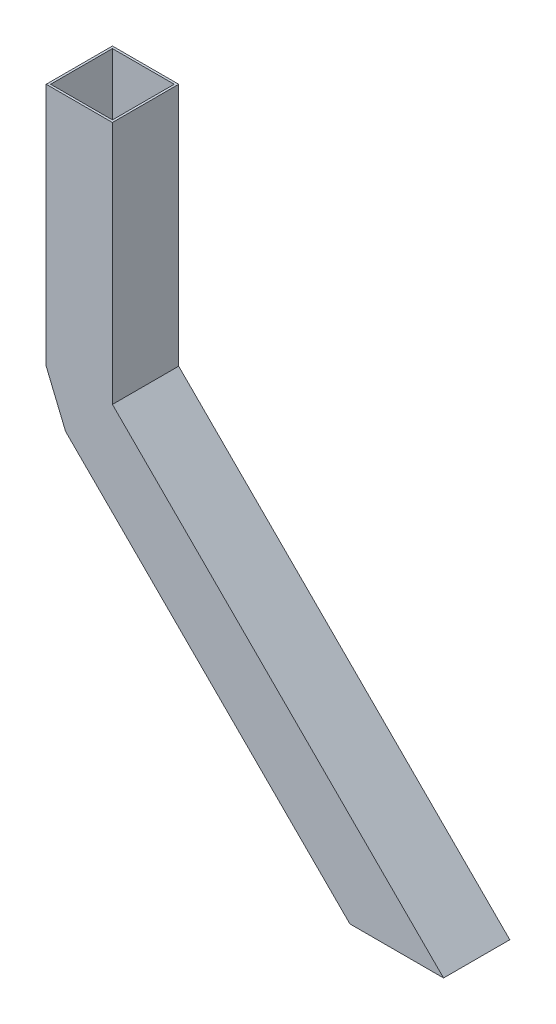
ISO-10303-21;
HEADER;
FILE_DESCRIPTION(('STEP AP214'),'2;1');
FILE_NAME('part.step','',(''),(''),'','','');
FILE_SCHEMA(('AUTOMOTIVE_DESIGN { 1 0 10303 214 1 1 1 1 }'));
ENDSEC;
DATA;
#1=APPLICATION_CONTEXT('core data for automotive mechanical design processes');
#2=APPLICATION_PROTOCOL_DEFINITION('international standard','automotive_design',2000,#1);
#3=PRODUCT_CONTEXT('',#1,'mechanical');
#4=PRODUCT('Part','Part','',(#3));
#5=PRODUCT_RELATED_PRODUCT_CATEGORY('part','',(#4));
#6=PRODUCT_DEFINITION_FORMATION('','',#4);
#7=PRODUCT_DEFINITION_CONTEXT('part definition',#1,'design');
#8=PRODUCT_DEFINITION('design','',#6,#7);
#9=PRODUCT_DEFINITION_SHAPE('','',#8);
#10=(LENGTH_UNIT() NAMED_UNIT(*) SI_UNIT(.MILLI.,.METRE.));
#11=(NAMED_UNIT(*) PLANE_ANGLE_UNIT() SI_UNIT($,.RADIAN.));
#12=(NAMED_UNIT(*) SI_UNIT($,.STERADIAN.) SOLID_ANGLE_UNIT());
#13=UNCERTAINTY_MEASURE_WITH_UNIT(LENGTH_MEASURE(1.E-05),#10,'distance_accuracy_value','');
#14=(GEOMETRIC_REPRESENTATION_CONTEXT(3) GLOBAL_UNCERTAINTY_ASSIGNED_CONTEXT((#13)) GLOBAL_UNIT_ASSIGNED_CONTEXT((#10,
#11,#12)) REPRESENTATION_CONTEXT('',''));
#15=CARTESIAN_POINT('',(0.,0.,0.));
#16=DIRECTION('',(0.,0.,1.));
#17=DIRECTION('',(1.,0.,0.));
#18=AXIS2_PLACEMENT_3D('',#15,#16,#17);
#19=CARTESIAN_POINT('',(0.,221.22,0.));
#20=DIRECTION('',(0.,-1.,0.));
#21=DIRECTION('',(0.,0.,-1.));
#22=AXIS2_PLACEMENT_3D('',#19,#20,#21);
#23=PLANE('',#22);
#24=DIRECTION('',(0.,0.,-1.));
#25=VECTOR('',#24,1.);
#26=CARTESIAN_POINT('',(30.0000000000001,221.22,30.));
#27=LINE('',#26,#25);
#28=CARTESIAN_POINT('',(30.0000000000001,221.22,30.));
#29=VERTEX_POINT('',#28);
#30=CARTESIAN_POINT('',(30.,221.22,-30.));
#31=VERTEX_POINT('',#30);
#32=EDGE_CURVE('E287',#29,#31,#27,.T.);
#33=ORIENTED_EDGE('',*,*,#32,.T.);
#34=DIRECTION('',(-1.,0.,0.));
#35=VECTOR('',#34,1.);
#36=CARTESIAN_POINT('',(-30.,221.22,-30.));
#37=LINE('',#36,#35);
#38=CARTESIAN_POINT('',(-30.,221.22,-30.));
#39=VERTEX_POINT('',#38);
#40=EDGE_CURVE('E291',#31,#39,#37,.T.);
#41=ORIENTED_EDGE('',*,*,#40,.T.);
#42=DIRECTION('',(0.,0.,1.));
#43=VECTOR('',#42,1.);
#44=CARTESIAN_POINT('',(-30.,221.22,30.));
#45=LINE('',#44,#43);
#46=CARTESIAN_POINT('',(-30.,221.22,30.));
#47=VERTEX_POINT('',#46);
#48=EDGE_CURVE('E295',#39,#47,#45,.T.);
#49=ORIENTED_EDGE('',*,*,#48,.T.);
#50=DIRECTION('',(1.,0.,0.));
#51=VECTOR('',#50,1.);
#52=CARTESIAN_POINT('',(-30.,221.22,30.));
#53=LINE('',#52,#51);
#54=EDGE_CURVE('E298',#47,#29,#53,.T.);
#55=ORIENTED_EDGE('',*,*,#54,.T.);
#56=EDGE_LOOP('',(#33,#41,#49,#55));
#57=FACE_BOUND('',#56,.T.);
#58=DIRECTION('',(1.,0.,0.));
#59=VECTOR('',#58,1.);
#60=CARTESIAN_POINT('',(-28.,221.22,28.));
#61=LINE('',#60,#59);
#62=CARTESIAN_POINT('',(-28.,221.22,28.));
#63=VERTEX_POINT('',#62);
#64=CARTESIAN_POINT('',(28.,221.22,28.));
#65=VERTEX_POINT('',#64);
#66=EDGE_CURVE('E257',#63,#65,#61,.T.);
#67=ORIENTED_EDGE('',*,*,#66,.F.);
#68=DIRECTION('',(0.,0.,1.));
#69=VECTOR('',#68,1.);
#70=CARTESIAN_POINT('',(-28.,221.22,28.));
#71=LINE('',#70,#69);
#72=CARTESIAN_POINT('',(-28.,221.22,-28.));
#73=VERTEX_POINT('',#72);
#74=EDGE_CURVE('E267',#73,#63,#71,.T.);
#75=ORIENTED_EDGE('',*,*,#74,.F.);
#76=DIRECTION('',(-1.,0.,0.));
#77=VECTOR('',#76,1.);
#78=CARTESIAN_POINT('',(-28.,221.22,-28.));
#79=LINE('',#78,#77);
#80=CARTESIAN_POINT('',(28.,221.22,-28.));
#81=VERTEX_POINT('',#80);
#82=EDGE_CURVE('E263',#81,#73,#79,.T.);
#83=ORIENTED_EDGE('',*,*,#82,.F.);
#84=DIRECTION('',(0.,0.,-1.));
#85=VECTOR('',#84,1.);
#86=CARTESIAN_POINT('',(28.,221.22,28.));
#87=LINE('',#86,#85);
#88=EDGE_CURVE('E260',#65,#81,#87,.T.);
#89=ORIENTED_EDGE('',*,*,#88,.F.);
#90=EDGE_LOOP('',(#67,#75,#83,#89));
#91=FACE_BOUND('',#90,.T.);
#92=ADVANCED_FACE('F46',(#57,#91),#23,.F.);
#93=CARTESIAN_POINT('',(30.0000000000001,221.22,30.));
#94=DIRECTION('',(-1.,0.,0.));
#95=DIRECTION('',(0.,0.,1.));
#96=AXIS2_PLACEMENT_3D('',#93,#94,#95);
#97=PLANE('',#96);
#98=DIRECTION('',(0.,0.,-1.));
#99=VECTOR('',#98,1.);
#100=CARTESIAN_POINT('',(30.0000000000001,0.,30.));
#101=LINE('',#100,#99);
#102=CARTESIAN_POINT('',(30.0000000000001,0.,30.));
#103=VERTEX_POINT('',#102);
#104=CARTESIAN_POINT('',(30.,0.,-30.));
#105=VERTEX_POINT('',#104);
#106=EDGE_CURVE('E286',#103,#105,#101,.T.);
#107=ORIENTED_EDGE('',*,*,#106,.T.);
#108=DIRECTION('',(0.,-1.,0.));
#109=VECTOR('',#108,1.);
#110=CARTESIAN_POINT('',(30.,221.22,-30.));
#111=LINE('',#110,#109);
#112=EDGE_CURVE('E55',#31,#105,#111,.T.);
#113=ORIENTED_EDGE('',*,*,#112,.F.);
#114=ORIENTED_EDGE('',*,*,#32,.F.);
#115=DIRECTION('',(0.,-1.,0.));
#116=VECTOR('',#115,1.);
#117=CARTESIAN_POINT('',(30.0000000000001,221.22,30.));
#118=LINE('',#117,#116);
#119=EDGE_CURVE('E301',#29,#103,#118,.T.);
#120=ORIENTED_EDGE('',*,*,#119,.T.);
#121=EDGE_LOOP('',(#107,#113,#114,#120));
#122=FACE_BOUND('',#121,.T.);
#123=ADVANCED_FACE('F48',(#122),#97,.F.);
#124=CARTESIAN_POINT('',(-30.,221.22,-30.));
#125=DIRECTION('',(0.,0.,1.));
#126=DIRECTION('',(1.,0.,0.));
#127=AXIS2_PLACEMENT_3D('',#124,#125,#126);
#128=PLANE('',#127);
#129=ORIENTED_EDGE('',*,*,#112,.T.);
#130=DIRECTION('',(-0.707106781186551,0.707106781186544,0.));
#131=VECTOR('',#130,1.);
#132=CARTESIAN_POINT('',(329.997122986206,-299.997122986203,-30.0000000000002));
#133=LINE('',#132,#131);
#134=CARTESIAN_POINT('',(329.997122986206,-299.997122986203,-30.0000000000002));
#135=VERTEX_POINT('',#134);
#136=EDGE_CURVE('E184',#135,#105,#133,.T.);
#137=ORIENTED_EDGE('',*,*,#136,.F.);
#138=DIRECTION('',(-1.,0.,0.));
#139=VECTOR('',#138,1.);
#140=CARTESIAN_POINT('',(329.997122986206,-299.997122986203,-30.0000000000002));
#141=LINE('',#140,#139);
#142=CARTESIAN_POINT('',(245.14430924382,-299.997122986203,-30.0000000000002));
#143=VERTEX_POINT('',#142);
#144=EDGE_CURVE('E168',#135,#143,#141,.T.);
#145=ORIENTED_EDGE('',*,*,#144,.T.);
#146=DIRECTION('',(-0.707106781186551,0.707106781186544,0.));
#147=VECTOR('',#146,1.);
#148=CARTESIAN_POINT('',(287.570716115014,-342.423529857396,-30.0000000000001));
#149=LINE('',#148,#147);
#150=CARTESIAN_POINT('',(-12.4264068711926,-42.4264068711931,-30.));
#151=VERTEX_POINT('',#150);
#152=EDGE_CURVE('E189',#143,#151,#149,.T.);
#153=ORIENTED_EDGE('',*,*,#152,.T.);
#154=DIRECTION('',(-0.382683432365093,0.923879532511286,0.));
#155=VECTOR('',#154,1.);
#156=CARTESIAN_POINT('',(-12.4264068711926,-42.4264068711931,-30.));
#157=LINE('',#156,#155);
#158=CARTESIAN_POINT('',(-30.,0.,-30.));
#159=VERTEX_POINT('',#158);
#160=EDGE_CURVE('E200',#151,#159,#157,.T.);
#161=ORIENTED_EDGE('',*,*,#160,.T.);
#162=DIRECTION('',(0.,-1.,0.));
#163=VECTOR('',#162,1.);
#164=CARTESIAN_POINT('',(-30.,221.22,-30.));
#165=LINE('',#164,#163);
#166=EDGE_CURVE('E314',#39,#159,#165,.T.);
#167=ORIENTED_EDGE('',*,*,#166,.F.);
#168=ORIENTED_EDGE('',*,*,#40,.F.);
#169=EDGE_LOOP('',(#129,#137,#145,#153,#161,#167,#168));
#170=FACE_BOUND('',#169,.T.);
#171=ADVANCED_FACE('F192',(#170),#128,.F.);
#172=CARTESIAN_POINT('',(-30.,221.22,30.));
#173=DIRECTION('',(1.,0.,0.));
#174=DIRECTION('',(0.,0.,-1.));
#175=AXIS2_PLACEMENT_3D('',#172,#173,#174);
#176=PLANE('',#175);
#177=DIRECTION('',(0.,0.,1.));
#178=VECTOR('',#177,1.);
#179=CARTESIAN_POINT('',(-30.,0.,30.));
#180=LINE('',#179,#178);
#181=CARTESIAN_POINT('',(-30.,0.,30.));
#182=VERTEX_POINT('',#181);
#183=EDGE_CURVE('E292',#159,#182,#180,.T.);
#184=ORIENTED_EDGE('',*,*,#183,.T.);
#185=DIRECTION('',(0.,-1.,0.));
#186=VECTOR('',#185,1.);
#187=CARTESIAN_POINT('',(-30.,221.22,30.));
#188=LINE('',#187,#186);
#189=EDGE_CURVE('E310',#47,#182,#188,.T.);
#190=ORIENTED_EDGE('',*,*,#189,.F.);
#191=ORIENTED_EDGE('',*,*,#48,.F.);
#192=ORIENTED_EDGE('',*,*,#166,.T.);
#193=EDGE_LOOP('',(#184,#190,#191,#192));
#194=FACE_BOUND('',#193,.T.);
#195=ADVANCED_FACE('F321',(#194),#176,.F.);
#196=CARTESIAN_POINT('',(-30.,221.22,30.));
#197=DIRECTION('',(0.,0.,-1.));
#198=DIRECTION('',(-1.,0.,0.));
#199=AXIS2_PLACEMENT_3D('',#196,#197,#198);
#200=PLANE('',#199);
#201=ORIENTED_EDGE('',*,*,#189,.T.);
#202=DIRECTION('',(-0.382683432365093,0.923879532511286,0.));
#203=VECTOR('',#202,1.);
#204=CARTESIAN_POINT('',(-12.4264068711926,-42.4264068711931,30.));
#205=LINE('',#204,#203);
#206=CARTESIAN_POINT('',(-12.4264068711926,-42.4264068711931,30.));
#207=VERTEX_POINT('',#206);
#208=EDGE_CURVE('E239',#207,#182,#205,.T.);
#209=ORIENTED_EDGE('',*,*,#208,.F.);
#210=DIRECTION('',(-0.707106781186551,0.707106781186544,0.));
#211=VECTOR('',#210,1.);
#212=CARTESIAN_POINT('',(287.570716115014,-342.423529857396,29.9999999999999));
#213=LINE('',#212,#211);
#214=CARTESIAN_POINT('',(245.14430924382,-299.997122986203,29.9999999999999));
#215=VERTEX_POINT('',#214);
#216=EDGE_CURVE('E202',#215,#207,#213,.T.);
#217=ORIENTED_EDGE('',*,*,#216,.F.);
#218=DIRECTION('',(-1.,0.,0.));
#219=VECTOR('',#218,1.);
#220=CARTESIAN_POINT('',(329.997122986206,-299.997122986203,30.));
#221=LINE('',#220,#219);
#222=CARTESIAN_POINT('',(329.997122986206,-299.997122986203,30.));
#223=VERTEX_POINT('',#222);
#224=EDGE_CURVE('E179',#223,#215,#221,.T.);
#225=ORIENTED_EDGE('',*,*,#224,.F.);
#226=DIRECTION('',(-0.707106781186551,0.707106781186544,0.));
#227=VECTOR('',#226,1.);
#228=CARTESIAN_POINT('',(329.997122986206,-299.997122986203,29.9999999999998));
#229=LINE('',#228,#227);
#230=EDGE_CURVE('E187',#223,#103,#229,.T.);
#231=ORIENTED_EDGE('',*,*,#230,.T.);
#232=ORIENTED_EDGE('',*,*,#119,.F.);
#233=ORIENTED_EDGE('',*,*,#54,.F.);
#234=EDGE_LOOP('',(#201,#209,#217,#225,#231,#232,#233));
#235=FACE_BOUND('',#234,.T.);
#236=ADVANCED_FACE('F330',(#235),#200,.F.);
#237=CARTESIAN_POINT('',(-28.,221.22,28.));
#238=DIRECTION('',(0.,0.,-1.));
#239=DIRECTION('',(-1.,0.,0.));
#240=AXIS2_PLACEMENT_3D('',#237,#238,#239);
#241=PLANE('',#240);
#242=DIRECTION('',(0.382683432365093,-0.923879532511286,0.));
#243=VECTOR('',#242,1.);
#244=CARTESIAN_POINT('',(-56.7069844126347,209.329177721454,28.));
#245=LINE('',#244,#243);
#246=CARTESIAN_POINT('',(12.4264068711926,42.4264068711931,28.));
#247=VERTEX_POINT('',#246);
#248=CARTESIAN_POINT('',(28.,4.82842712474621,28.));
#249=VERTEX_POINT('',#248);
#250=EDGE_CURVE('E62',#247,#249,#245,.T.);
#251=ORIENTED_EDGE('',*,*,#250,.F.);
#252=DIRECTION('',(-0.707106781186544,-0.707106781186551,0.));
#253=VECTOR('',#252,1.);
#254=CARTESIAN_POINT('',(81.61,111.610000000001,28.));
#255=LINE('',#254,#253);
#256=CARTESIAN_POINT('',(11.0121933088195,41.01219330882,28.));
#257=VERTEX_POINT('',#256);
#258=EDGE_CURVE('E247',#247,#257,#255,.T.);
#259=ORIENTED_EDGE('',*,*,#258,.T.);
#260=DIRECTION('',(-0.382683432365093,0.923879532511286,0.));
#261=VECTOR('',#260,1.);
#262=CARTESIAN_POINT('',(28.585786437627,-1.41421356237313,28.));
#263=LINE('',#262,#261);
#264=CARTESIAN_POINT('',(28.585786437627,-1.41421356237312,28.));
#265=VERTEX_POINT('',#264);
#266=EDGE_CURVE('E70',#265,#257,#263,.T.);
#267=ORIENTED_EDGE('',*,*,#266,.F.);
#268=DIRECTION('',(-0.707106781186551,0.707106781186544,0.));
#269=VECTOR('',#268,1.);
#270=CARTESIAN_POINT('',(328.582909423833,-301.411336548576,27.9999999999998));
#271=LINE('',#270,#269);
#272=CARTESIAN_POINT('',(327.16869586146,-299.997122986203,27.9999999999998));
#273=VERTEX_POINT('',#272);
#274=EDGE_CURVE('E351',#273,#265,#271,.T.);
#275=ORIENTED_EDGE('',*,*,#274,.F.);
#276=DIRECTION('',(1.,0.,0.));
#277=VECTOR('',#276,1.);
#278=CARTESIAN_POINT('',(288.984929677387,-299.997122986203,27.9999999999999));
#279=LINE('',#278,#277);
#280=CARTESIAN_POINT('',(247.972736368566,-299.997122986203,28.));
#281=VERTEX_POINT('',#280);
#282=EDGE_CURVE('E348',#281,#273,#279,.T.);
#283=ORIENTED_EDGE('',*,*,#282,.F.);
#284=DIRECTION('',(-0.707106781186551,0.707106781186544,0.));
#285=VECTOR('',#284,1.);
#286=CARTESIAN_POINT('',(288.984929677387,-341.009316295023,27.9999999999999));
#287=LINE('',#286,#285);
#288=CARTESIAN_POINT('',(-11.0121933088195,-41.01219330882,28.));
#289=VERTEX_POINT('',#288);
#290=EDGE_CURVE('E190',#281,#289,#287,.T.);
#291=ORIENTED_EDGE('',*,*,#290,.T.);
#292=DIRECTION('',(-0.382683432365093,0.923879532511286,0.));
#293=VECTOR('',#292,1.);
#294=CARTESIAN_POINT('',(-11.0121933088195,-41.01219330882,28.));
#295=LINE('',#294,#293);
#296=CARTESIAN_POINT('',(-28.,0.,28.));
#297=VERTEX_POINT('',#296);
#298=EDGE_CURVE('E217',#289,#297,#295,.T.);
#299=ORIENTED_EDGE('',*,*,#298,.T.);
#300=DIRECTION('',(0.,-1.,0.));
#301=VECTOR('',#300,1.);
#302=CARTESIAN_POINT('',(-28.,221.22,28.));
#303=LINE('',#302,#301);
#304=EDGE_CURVE('E270',#63,#297,#303,.T.);
#305=ORIENTED_EDGE('',*,*,#304,.F.);
#306=ORIENTED_EDGE('',*,*,#66,.T.);
#307=DIRECTION('',(0.,-1.,0.));
#308=VECTOR('',#307,1.);
#309=CARTESIAN_POINT('',(28.,221.22,28.));
#310=LINE('',#309,#308);
#311=EDGE_CURVE('E283',#65,#249,#310,.T.);
#312=ORIENTED_EDGE('',*,*,#311,.T.);
#313=EDGE_LOOP('',(#251,#259,#267,#275,#283,#291,#299,#305,#306,#312));
#314=FACE_BOUND('',#313,.T.);
#315=ADVANCED_FACE('F386',(#314),#241,.T.);
#316=CARTESIAN_POINT('',(28.,221.22,28.));
#317=DIRECTION('',(-1.,0.,0.));
#318=DIRECTION('',(0.,0.,1.));
#319=AXIS2_PLACEMENT_3D('',#316,#317,#318);
#320=PLANE('',#319);
#321=DIRECTION('',(0.,0.,-1.));
#322=VECTOR('',#321,1.);
#323=CARTESIAN_POINT('',(28.,4.82842712474624,28.0000000000002));
#324=LINE('',#323,#322);
#325=CARTESIAN_POINT('',(28.,4.82842712474615,-28.));
#326=VERTEX_POINT('',#325);
#327=EDGE_CURVE('E250',#249,#326,#324,.T.);
#328=ORIENTED_EDGE('',*,*,#327,.F.);
#329=ORIENTED_EDGE('',*,*,#311,.F.);
#330=ORIENTED_EDGE('',*,*,#88,.T.);
#331=DIRECTION('',(0.,-1.,0.));
#332=VECTOR('',#331,1.);
#333=CARTESIAN_POINT('',(28.,221.22,-28.));
#334=LINE('',#333,#332);
#335=EDGE_CURVE('E279',#81,#326,#334,.T.);
#336=ORIENTED_EDGE('',*,*,#335,.T.);
#337=EDGE_LOOP('',(#328,#329,#330,#336));
#338=FACE_BOUND('',#337,.T.);
#339=ADVANCED_FACE('F447',(#338),#320,.T.);
#340=CARTESIAN_POINT('',(-28.,221.22,-28.));
#341=DIRECTION('',(0.,0.,1.));
#342=DIRECTION('',(1.,0.,0.));
#343=AXIS2_PLACEMENT_3D('',#340,#341,#342);
#344=PLANE('',#343);
#345=DIRECTION('',(-0.382683432365093,0.923879532511286,0.));
#346=VECTOR('',#345,1.);
#347=CARTESIAN_POINT('',(-56.7069844126347,209.329177721454,-28.));
#348=LINE('',#347,#346);
#349=CARTESIAN_POINT('',(12.4264068711926,42.4264068711931,-28.));
#350=VERTEX_POINT('',#349);
#351=EDGE_CURVE('E11',#326,#350,#348,.T.);
#352=ORIENTED_EDGE('',*,*,#351,.F.);
#353=ORIENTED_EDGE('',*,*,#335,.F.);
#354=ORIENTED_EDGE('',*,*,#82,.T.);
#355=DIRECTION('',(0.,-1.,0.));
#356=VECTOR('',#355,1.);
#357=CARTESIAN_POINT('',(-28.,221.22,-28.));
#358=LINE('',#357,#356);
#359=CARTESIAN_POINT('',(-28.,0.,-28.));
#360=VERTEX_POINT('',#359);
#361=EDGE_CURVE('E276',#73,#360,#358,.T.);
#362=ORIENTED_EDGE('',*,*,#361,.T.);
#363=DIRECTION('',(-0.382683432365093,0.923879532511286,0.));
#364=VECTOR('',#363,1.);
#365=CARTESIAN_POINT('',(-11.0121933088195,-41.01219330882,-28.));
#366=LINE('',#365,#364);
#367=CARTESIAN_POINT('',(-11.0121933088195,-41.01219330882,-28.));
#368=VERTEX_POINT('',#367);
#369=EDGE_CURVE('E212',#368,#360,#366,.T.);
#370=ORIENTED_EDGE('',*,*,#369,.F.);
#371=DIRECTION('',(-0.707106781186551,0.707106781186544,0.));
#372=VECTOR('',#371,1.);
#373=CARTESIAN_POINT('',(288.984929677387,-341.009316295023,-28.0000000000001));
#374=LINE('',#373,#372);
#375=CARTESIAN_POINT('',(247.972736368566,-299.997122986203,-28.0000000000001));
#376=VERTEX_POINT('',#375);
#377=EDGE_CURVE('E357',#376,#368,#374,.T.);
#378=ORIENTED_EDGE('',*,*,#377,.F.);
#379=DIRECTION('',(-1.,0.,0.));
#380=VECTOR('',#379,1.);
#381=CARTESIAN_POINT('',(288.984929677387,-299.997122986203,-28.0000000000001));
#382=LINE('',#381,#380);
#383=CARTESIAN_POINT('',(327.16869586146,-299.997122986203,-28.0000000000001));
#384=VERTEX_POINT('',#383);
#385=EDGE_CURVE('E342',#384,#376,#382,.T.);
#386=ORIENTED_EDGE('',*,*,#385,.F.);
#387=DIRECTION('',(-0.707106781186551,0.707106781186544,0.));
#388=VECTOR('',#387,1.);
#389=CARTESIAN_POINT('',(328.582909423833,-301.411336548576,-28.0000000000001));
#390=LINE('',#389,#388);
#391=CARTESIAN_POINT('',(28.5857864376269,-1.4142135623731,-28.));
#392=VERTEX_POINT('',#391);
#393=EDGE_CURVE('E354',#384,#392,#390,.T.);
#394=ORIENTED_EDGE('',*,*,#393,.T.);
#395=DIRECTION('',(-0.382683432365093,0.923879532511286,0.));
#396=VECTOR('',#395,1.);
#397=CARTESIAN_POINT('',(28.5857864376269,-1.41421356237311,-28.));
#398=LINE('',#397,#396);
#399=CARTESIAN_POINT('',(11.0121933088195,41.01219330882,-28.));
#400=VERTEX_POINT('',#399);
#401=EDGE_CURVE('E216',#392,#400,#398,.T.);
#402=ORIENTED_EDGE('',*,*,#401,.T.);
#403=DIRECTION('',(0.707106781186544,0.707106781186551,0.));
#404=VECTOR('',#403,1.);
#405=CARTESIAN_POINT('',(81.61,111.610000000001,-28.));
#406=LINE('',#405,#404);
#407=EDGE_CURVE('E231',#400,#350,#406,.T.);
#408=ORIENTED_EDGE('',*,*,#407,.T.);
#409=EDGE_LOOP('',(#352,#353,#354,#362,#370,#378,#386,#394,#402,#408));
#410=FACE_BOUND('',#409,.T.);
#411=ADVANCED_FACE('F438',(#410),#344,.T.);
#412=CARTESIAN_POINT('',(-28.,221.22,28.));
#413=DIRECTION('',(1.,0.,0.));
#414=DIRECTION('',(0.,0.,-1.));
#415=AXIS2_PLACEMENT_3D('',#412,#413,#414);
#416=PLANE('',#415);
#417=DIRECTION('',(0.,0.,1.));
#418=VECTOR('',#417,1.);
#419=CARTESIAN_POINT('',(-28.,0.,28.));
#420=LINE('',#419,#418);
#421=EDGE_CURVE('E256',#360,#297,#420,.T.);
#422=ORIENTED_EDGE('',*,*,#421,.F.);
#423=ORIENTED_EDGE('',*,*,#361,.F.);
#424=ORIENTED_EDGE('',*,*,#74,.T.);
#425=ORIENTED_EDGE('',*,*,#304,.T.);
#426=EDGE_LOOP('',(#422,#423,#424,#425));
#427=FACE_BOUND('',#426,.T.);
#428=ADVANCED_FACE('F433',(#427),#416,.T.);
#429=CARTESIAN_POINT('',(28.5857864376269,-1.41421356237311,-28.));
#430=DIRECTION('',(-0.923879532511286,-0.382683432365093,0.));
#431=DIRECTION('',(0.382683432365093,-0.923879532511286,0.));
#432=AXIS2_PLACEMENT_3D('',#429,#430,#431);
#433=PLANE('',#432);
#434=ORIENTED_EDGE('',*,*,#266,.T.);
#435=DIRECTION('',(0.,0.,-1.));
#436=VECTOR('',#435,1.);
#437=CARTESIAN_POINT('',(11.0121933088195,41.01219330882,-28.));
#438=LINE('',#437,#436);
#439=EDGE_CURVE('E223',#400,#257,#438,.F.);
#440=ORIENTED_EDGE('',*,*,#439,.F.);
#441=ORIENTED_EDGE('',*,*,#401,.F.);
#442=DIRECTION('',(0.,0.,-1.));
#443=VECTOR('',#442,1.);
#444=CARTESIAN_POINT('',(28.5857864376269,-1.41421356237311,-28.));
#445=LINE('',#444,#443);
#446=EDGE_CURVE('E210',#392,#265,#445,.F.);
#447=ORIENTED_EDGE('',*,*,#446,.T.);
#448=EDGE_LOOP('',(#434,#440,#441,#447));
#449=FACE_BOUND('',#448,.T.);
#450=ADVANCED_FACE('F437',(#449),#433,.T.);
#451=CARTESIAN_POINT('',(-12.4264068711926,-42.4264068711931,30.));
#452=DIRECTION('',(-0.923879532511286,-0.382683432365093,0.));
#453=DIRECTION('',(0.382683432365093,-0.923879532511286,0.));
#454=AXIS2_PLACEMENT_3D('',#451,#452,#453);
#455=PLANE('',#454);
#456=ORIENTED_EDGE('',*,*,#208,.T.);
#457=ORIENTED_EDGE('',*,*,#183,.F.);
#458=ORIENTED_EDGE('',*,*,#160,.F.);
#459=DIRECTION('',(0.,0.,1.));
#460=VECTOR('',#459,1.);
#461=CARTESIAN_POINT('',(-12.4264068711926,-42.4264068711931,30.));
#462=LINE('',#461,#460);
#463=EDGE_CURVE('E235',#151,#207,#462,.T.);
#464=ORIENTED_EDGE('',*,*,#463,.T.);
#465=EDGE_LOOP('',(#456,#457,#458,#464));
#466=FACE_BOUND('',#465,.T.);
#467=ADVANCED_FACE('F326',(#466),#455,.T.);
#468=CARTESIAN_POINT('',(30.,0.,-30.));
#469=DIRECTION('',(0.923879532511286,0.382683432365093,0.));
#470=DIRECTION('',(-0.382683432365093,0.923879532511286,0.));
#471=AXIS2_PLACEMENT_3D('',#468,#469,#470);
#472=PLANE('',#471);
#473=DIRECTION('',(0.,0.,-1.));
#474=VECTOR('',#473,1.);
#475=CARTESIAN_POINT('',(12.4264068711926,42.4264068711931,-30.));
#476=LINE('',#475,#474);
#477=EDGE_CURVE('E211',#247,#350,#476,.T.);
#478=ORIENTED_EDGE('',*,*,#477,.F.);
#479=ORIENTED_EDGE('',*,*,#250,.T.);
#480=ORIENTED_EDGE('',*,*,#327,.T.);
#481=ORIENTED_EDGE('',*,*,#351,.T.);
#482=EDGE_LOOP('',(#478,#479,#480,#481));
#483=FACE_BOUND('',#482,.T.);
#484=ADVANCED_FACE('F530',(#483),#472,.T.);
#485=CARTESIAN_POINT('',(-2.57359312880722,27.426406871193,0.));
#486=DIRECTION('',(0.707106781186551,-0.707106781186544,0.));
#487=DIRECTION('',(0.707106781186544,0.707106781186551,0.));
#488=AXIS2_PLACEMENT_3D('',#485,#486,#487);
#489=PLANE('',#488);
#490=ORIENTED_EDGE('',*,*,#258,.F.);
#491=ORIENTED_EDGE('',*,*,#477,.T.);
#492=ORIENTED_EDGE('',*,*,#407,.F.);
#493=ORIENTED_EDGE('',*,*,#439,.T.);
#494=EDGE_LOOP('',(#490,#491,#492,#493));
#495=FACE_BOUND('',#494,.T.);
#496=ADVANCED_FACE('F539',(#495),#489,.F.);
#497=CARTESIAN_POINT('',(-11.0121933088195,-41.01219330882,28.));
#498=DIRECTION('',(0.923879532511286,0.382683432365093,0.));
#499=DIRECTION('',(-0.382683432365093,0.923879532511286,0.));
#500=AXIS2_PLACEMENT_3D('',#497,#498,#499);
#501=PLANE('',#500);
#502=ORIENTED_EDGE('',*,*,#369,.T.);
#503=ORIENTED_EDGE('',*,*,#421,.T.);
#504=ORIENTED_EDGE('',*,*,#298,.F.);
#505=DIRECTION('',(0.,0.,1.));
#506=VECTOR('',#505,1.);
#507=CARTESIAN_POINT('',(-11.0121933088195,-41.01219330882,28.));
#508=LINE('',#507,#506);
#509=EDGE_CURVE('E206',#289,#368,#508,.F.);
#510=ORIENTED_EDGE('',*,*,#509,.T.);
#511=EDGE_LOOP('',(#502,#503,#504,#510));
#512=FACE_BOUND('',#511,.T.);
#513=ADVANCED_FACE('F376',(#512),#501,.T.);
#514=CARTESIAN_POINT('',(329.997122986206,-299.997122986203,29.9999999999998));
#515=DIRECTION('',(-0.707106781186544,-0.707106781186551,0.));
#516=DIRECTION('',(0.707106781186551,-0.707106781186544,0.));
#517=AXIS2_PLACEMENT_3D('',#514,#515,#516);
#518=PLANE('',#517);
#519=ORIENTED_EDGE('',*,*,#106,.F.);
#520=ORIENTED_EDGE('',*,*,#230,.F.);
#521=DIRECTION('',(0.,0.,1.));
#522=VECTOR('',#521,1.);
#523=CARTESIAN_POINT('',(329.997122986206,-299.997122986203,29.9999999999998));
#524=LINE('',#523,#522);
#525=EDGE_CURVE('E171',#135,#223,#524,.T.);
#526=ORIENTED_EDGE('',*,*,#525,.F.);
#527=ORIENTED_EDGE('',*,*,#136,.T.);
#528=EDGE_LOOP('',(#519,#520,#526,#527));
#529=FACE_BOUND('',#528,.T.);
#530=ADVANCED_FACE('F183',(#529),#518,.F.);
#531=CARTESIAN_POINT('',(287.570716115014,-342.423529857396,29.9999999999999));
#532=DIRECTION('',(0.707106781186544,0.707106781186551,0.));
#533=DIRECTION('',(-0.707106781186551,0.707106781186544,0.));
#534=AXIS2_PLACEMENT_3D('',#531,#532,#533);
#535=PLANE('',#534);
#536=ORIENTED_EDGE('',*,*,#152,.F.);
#537=DIRECTION('',(0.,0.,1.));
#538=VECTOR('',#537,1.);
#539=CARTESIAN_POINT('',(245.14430924382,-299.997122986203,-30.0000000000002));
#540=LINE('',#539,#538);
#541=EDGE_CURVE('E174',#143,#215,#540,.T.);
#542=ORIENTED_EDGE('',*,*,#541,.T.);
#543=ORIENTED_EDGE('',*,*,#216,.T.);
#544=ORIENTED_EDGE('',*,*,#463,.F.);
#545=EDGE_LOOP('',(#536,#542,#543,#544));
#546=FACE_BOUND('',#545,.T.);
#547=ADVANCED_FACE('F365',(#546),#535,.F.);
#548=CARTESIAN_POINT('',(288.984929677387,-341.009316295023,27.9999999999999));
#549=DIRECTION('',(0.707106781186544,0.707106781186551,0.));
#550=DIRECTION('',(-0.707106781186551,0.707106781186544,0.));
#551=AXIS2_PLACEMENT_3D('',#548,#549,#550);
#552=PLANE('',#551);
#553=DIRECTION('',(0.,0.,1.));
#554=VECTOR('',#553,1.);
#555=CARTESIAN_POINT('',(247.972736368566,-299.997122986203,27.9999999999999));
#556=LINE('',#555,#554);
#557=EDGE_CURVE('E345',#376,#281,#556,.T.);
#558=ORIENTED_EDGE('',*,*,#557,.F.);
#559=ORIENTED_EDGE('',*,*,#377,.T.);
#560=ORIENTED_EDGE('',*,*,#509,.F.);
#561=ORIENTED_EDGE('',*,*,#290,.F.);
#562=EDGE_LOOP('',(#558,#559,#560,#561));
#563=FACE_BOUND('',#562,.T.);
#564=ADVANCED_FACE('F367',(#563),#552,.T.);
#565=CARTESIAN_POINT('',(328.582909423833,-301.411336548576,27.9999999999998));
#566=DIRECTION('',(-0.707106781186544,-0.707106781186551,0.));
#567=DIRECTION('',(0.707106781186551,-0.707106781186544,0.));
#568=AXIS2_PLACEMENT_3D('',#565,#566,#567);
#569=PLANE('',#568);
#570=DIRECTION('',(0.,0.,-1.));
#571=VECTOR('',#570,1.);
#572=CARTESIAN_POINT('',(327.16869586146,-299.997122986203,27.9999999999998));
#573=LINE('',#572,#571);
#574=EDGE_CURVE('E196',#273,#384,#573,.T.);
#575=ORIENTED_EDGE('',*,*,#574,.F.);
#576=ORIENTED_EDGE('',*,*,#274,.T.);
#577=ORIENTED_EDGE('',*,*,#446,.F.);
#578=ORIENTED_EDGE('',*,*,#393,.F.);
#579=EDGE_LOOP('',(#575,#576,#577,#578));
#580=FACE_BOUND('',#579,.T.);
#581=ADVANCED_FACE('F373',(#580),#569,.T.);
#582=CARTESIAN_POINT('',(329.997122986206,-299.997122986203,-30.0000000000002));
#583=DIRECTION('',(0.,1.,0.));
#584=DIRECTION('',(0.,0.,1.));
#585=AXIS2_PLACEMENT_3D('',#582,#583,#584);
#586=PLANE('',#585);
#587=ORIENTED_EDGE('',*,*,#282,.T.);
#588=ORIENTED_EDGE('',*,*,#574,.T.);
#589=ORIENTED_EDGE('',*,*,#385,.T.);
#590=ORIENTED_EDGE('',*,*,#557,.T.);
#591=EDGE_LOOP('',(#587,#588,#589,#590));
#592=FACE_BOUND('',#591,.T.);
#593=ORIENTED_EDGE('',*,*,#224,.T.);
#594=ORIENTED_EDGE('',*,*,#541,.F.);
#595=ORIENTED_EDGE('',*,*,#144,.F.);
#596=ORIENTED_EDGE('',*,*,#525,.T.);
#597=EDGE_LOOP('',(#593,#594,#595,#596));
#598=FACE_BOUND('',#597,.T.);
#599=ADVANCED_FACE('F170',(#592,#598),#586,.F.);
#600=CLOSED_SHELL('',(#92,#123,#171,#195,#236,#315,#339,#411,#428,#450,#467,#484,#496,#513,#530,
#547,#564,#581,#599));
#601=MANIFOLD_SOLID_BREP('B2',#600);
#602=ADVANCED_BREP_SHAPE_REPRESENTATION('',(#18,#601),#14);
#603=SHAPE_DEFINITION_REPRESENTATION(#9,#602);
ENDSEC;
END-ISO-10303-21;
